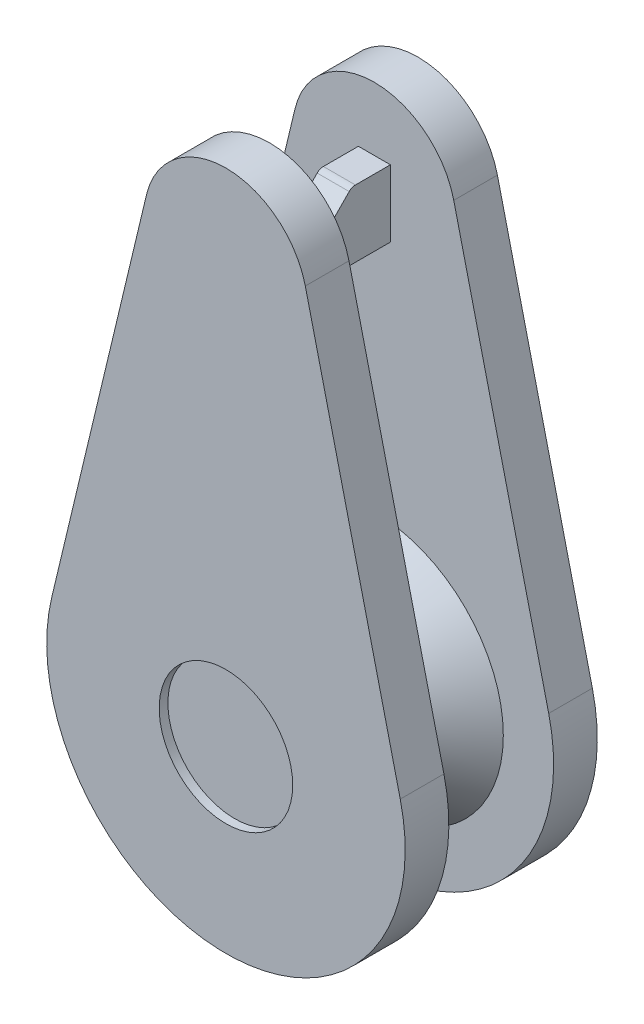
ISO-10303-21;
HEADER;
FILE_DESCRIPTION(('STEP AP214'),'2;1');
FILE_NAME('part.step','',(''),(''),'','','');
FILE_SCHEMA(('AUTOMOTIVE_DESIGN { 1 0 10303 214 1 1 1 1 }'));
ENDSEC;
DATA;
#1=APPLICATION_CONTEXT('core data for automotive mechanical design processes');
#2=APPLICATION_PROTOCOL_DEFINITION('international standard','automotive_design',2000,#1);
#3=PRODUCT_CONTEXT('',#1,'mechanical');
#4=PRODUCT('Part','Part','',(#3));
#5=PRODUCT_RELATED_PRODUCT_CATEGORY('part','',(#4));
#6=PRODUCT_DEFINITION_FORMATION('','',#4);
#7=PRODUCT_DEFINITION_CONTEXT('part definition',#1,'design');
#8=PRODUCT_DEFINITION('design','',#6,#7);
#9=PRODUCT_DEFINITION_SHAPE('','',#8);
#10=(LENGTH_UNIT() NAMED_UNIT(*) SI_UNIT(.MILLI.,.METRE.));
#11=(NAMED_UNIT(*) PLANE_ANGLE_UNIT() SI_UNIT($,.RADIAN.));
#12=(NAMED_UNIT(*) SI_UNIT($,.STERADIAN.) SOLID_ANGLE_UNIT());
#13=UNCERTAINTY_MEASURE_WITH_UNIT(LENGTH_MEASURE(1.E-05),#10,'distance_accuracy_value','');
#14=(GEOMETRIC_REPRESENTATION_CONTEXT(3) GLOBAL_UNCERTAINTY_ASSIGNED_CONTEXT((#13)) GLOBAL_UNIT_ASSIGNED_CONTEXT((#10,
#11,#12)) REPRESENTATION_CONTEXT('',''));
#15=CARTESIAN_POINT('',(0.,0.,0.));
#16=DIRECTION('',(0.,0.,1.));
#17=DIRECTION('',(1.,0.,0.));
#18=AXIS2_PLACEMENT_3D('',#15,#16,#17);
#19=CARTESIAN_POINT('',(24.5,136.000000000001,1.));
#20=DIRECTION('',(0.,0.,1.));
#21=DIRECTION('',(1.,0.,0.));
#22=AXIS2_PLACEMENT_3D('',#19,#20,#21);
#23=PLANE('',#22);
#24=CARTESIAN_POINT('',(24.5,136.000000000001,1.));
#25=DIRECTION('',(0.,0.,1.));
#26=DIRECTION('',(1.,0.,0.));
#27=AXIS2_PLACEMENT_3D('',#24,#25,#26);
#28=CIRCLE('',#27,4.10494291795747);
#29=CARTESIAN_POINT('',(20.5076953119614,136.955018134674,1.));
#30=VERTEX_POINT('',#29);
#31=CARTESIAN_POINT('',(28.4923043974712,136.955019349345,1.));
#32=VERTEX_POINT('',#31);
#33=EDGE_CURVE('E269',#30,#32,#28,.T.);
#34=ORIENTED_EDGE('',*,*,#33,.T.);
#35=DIRECTION('',(-0.232651066879886,0.972560271180995,0.));
#36=VECTOR('',#35,1.);
#37=CARTESIAN_POINT('',(26.3178255819127,146.045077413118,1.));
#38=LINE('',#37,#36);
#39=CARTESIAN_POINT('',(26.3178255819127,146.045077413118,1.));
#40=VERTEX_POINT('',#39);
#41=EDGE_CURVE('E272',#32,#40,#38,.T.);
#42=ORIENTED_EDGE('',*,*,#41,.T.);
#43=CARTESIAN_POINT('',(24.5,145.606873612069,1.));
#44=DIRECTION('',(0.,0.,1.));
#45=DIRECTION('',(-1.,0.,0.));
#46=AXIS2_PLACEMENT_3D('',#43,#44,#45);
#47=CIRCLE('',#46,1.86989636544635);
#48=CARTESIAN_POINT('',(22.681412951381,146.041906443135,1.));
#49=VERTEX_POINT('',#48);
#50=EDGE_CURVE('E275',#40,#49,#47,.T.);
#51=ORIENTED_EDGE('',*,*,#50,.T.);
#52=DIRECTION('',(-0.232650770975412,-0.972560341965755,0.));
#53=VECTOR('',#52,1.);
#54=CARTESIAN_POINT('',(20.5076953119614,136.955018134674,1.));
#55=LINE('',#54,#53);
#56=EDGE_CURVE('E277',#49,#30,#55,.T.);
#57=ORIENTED_EDGE('',*,*,#56,.T.);
#58=EDGE_LOOP('',(#34,#42,#51,#57));
#59=FACE_BOUND('',#58,.T.);
#60=CARTESIAN_POINT('',(24.5,136.000000000001,1.));
#61=DIRECTION('',(0.,0.,1.));
#62=DIRECTION('',(1.,0.,0.));
#63=AXIS2_PLACEMENT_3D('',#60,#61,#62);
#64=CIRCLE('',#63,2.95273846712997);
#65=CARTESIAN_POINT('',(27.45273846713,136.000000000001,1.));
#66=VERTEX_POINT('',#65);
#67=EDGE_CURVE('E265',#66,#66,#64,.T.);
#68=ORIENTED_EDGE('',*,*,#67,.F.);
#69=EDGE_LOOP('',(#68));
#70=FACE_BOUND('',#69,.T.);
#71=DIRECTION('',(-1.,0.,0.));
#72=VECTOR('',#71,1.);
#73=CARTESIAN_POINT('',(24.1333720619488,146.024420810161,1.));
#74=LINE('',#73,#72);
#75=CARTESIAN_POINT('',(24.8666279380512,146.024420810161,1.));
#76=VERTEX_POINT('',#75);
#77=CARTESIAN_POINT('',(24.1333720619488,146.024420810161,1.));
#78=VERTEX_POINT('',#77);
#79=EDGE_CURVE('E248',#76,#78,#74,.T.);
#80=ORIENTED_EDGE('',*,*,#79,.F.);
#81=DIRECTION('',(0.,1.,0.));
#82=VECTOR('',#81,1.);
#83=CARTESIAN_POINT('',(24.8666279380512,146.024420810161,1.));
#84=LINE('',#83,#82);
#85=CARTESIAN_POINT('',(24.8666279380512,144.490732446669,1.));
#86=VERTEX_POINT('',#85);
#87=EDGE_CURVE('E245',#86,#76,#84,.T.);
#88=ORIENTED_EDGE('',*,*,#87,.F.);
#89=DIRECTION('',(1.,0.,0.));
#90=VECTOR('',#89,1.);
#91=CARTESIAN_POINT('',(24.1333720619488,144.490732446669,1.));
#92=LINE('',#91,#90);
#93=CARTESIAN_POINT('',(24.1333720619488,144.490732446669,1.));
#94=VERTEX_POINT('',#93);
#95=EDGE_CURVE('E254',#94,#86,#92,.T.);
#96=ORIENTED_EDGE('',*,*,#95,.F.);
#97=DIRECTION('',(0.,-1.,0.));
#98=VECTOR('',#97,1.);
#99=CARTESIAN_POINT('',(24.1333720619488,146.024420810161,1.));
#100=LINE('',#99,#98);
#101=EDGE_CURVE('E251',#78,#94,#100,.T.);
#102=ORIENTED_EDGE('',*,*,#101,.F.);
#103=EDGE_LOOP('',(#80,#88,#96,#102));
#104=FACE_BOUND('',#103,.T.);
#105=ADVANCED_FACE('F38',(#59,#70,#104),#23,.T.);
#106=CARTESIAN_POINT('',(24.5,136.000000000001,1.));
#107=DIRECTION('',(0.,0.,-1.));
#108=DIRECTION('',(-1.,0.,0.));
#109=AXIS2_PLACEMENT_3D('',#106,#107,#108);
#110=CYLINDRICAL_SURFACE('',#109,4.10494291795747);
#111=CARTESIAN_POINT('',(24.5,136.000000000001,0.));
#112=DIRECTION('',(0.,0.,1.));
#113=DIRECTION('',(1.,0.,0.));
#114=AXIS2_PLACEMENT_3D('',#111,#112,#113);
#115=CIRCLE('',#114,4.10494291795747);
#116=CARTESIAN_POINT('',(20.5076953119614,136.955018134674,0.));
#117=VERTEX_POINT('',#116);
#118=CARTESIAN_POINT('',(28.4923043974712,136.955019349345,0.));
#119=VERTEX_POINT('',#118);
#120=EDGE_CURVE('E268',#117,#119,#115,.T.);
#121=ORIENTED_EDGE('',*,*,#120,.T.);
#122=DIRECTION('',(0.,0.,-1.));
#123=VECTOR('',#122,1.);
#124=CARTESIAN_POINT('',(28.4923043974712,136.955019349345,1.));
#125=LINE('',#124,#123);
#126=EDGE_CURVE('E295',#32,#119,#125,.T.);
#127=ORIENTED_EDGE('',*,*,#126,.F.);
#128=ORIENTED_EDGE('',*,*,#33,.F.);
#129=DIRECTION('',(0.,0.,-1.));
#130=VECTOR('',#129,1.);
#131=CARTESIAN_POINT('',(20.5076953119614,136.955018134674,1.));
#132=LINE('',#131,#130);
#133=EDGE_CURVE('E279',#30,#117,#132,.T.);
#134=ORIENTED_EDGE('',*,*,#133,.T.);
#135=EDGE_LOOP('',(#121,#127,#128,#134));
#136=FACE_BOUND('',#135,.T.);
#137=ADVANCED_FACE('F328',(#136),#110,.T.);
#138=CARTESIAN_POINT('',(26.3178255819127,146.045077413118,1.));
#139=DIRECTION('',(-0.972560271180995,-0.232651066879886,0.));
#140=DIRECTION('',(0.232651066879886,-0.972560271180995,0.));
#141=AXIS2_PLACEMENT_3D('',#138,#139,#140);
#142=PLANE('',#141);
#143=DIRECTION('',(-0.232651066879886,0.972560271180995,0.));
#144=VECTOR('',#143,1.);
#145=CARTESIAN_POINT('',(26.3178255819127,146.045077413118,0.));
#146=LINE('',#145,#144);
#147=CARTESIAN_POINT('',(26.3178255819127,146.045077413118,0.));
#148=VERTEX_POINT('',#147);
#149=EDGE_CURVE('E282',#119,#148,#146,.T.);
#150=ORIENTED_EDGE('',*,*,#149,.T.);
#151=DIRECTION('',(0.,0.,-1.));
#152=VECTOR('',#151,1.);
#153=CARTESIAN_POINT('',(26.3178255819127,146.045077413118,1.));
#154=LINE('',#153,#152);
#155=EDGE_CURVE('E292',#40,#148,#154,.T.);
#156=ORIENTED_EDGE('',*,*,#155,.F.);
#157=ORIENTED_EDGE('',*,*,#41,.F.);
#158=ORIENTED_EDGE('',*,*,#126,.T.);
#159=EDGE_LOOP('',(#150,#156,#157,#158));
#160=FACE_BOUND('',#159,.T.);
#161=ADVANCED_FACE('F334',(#160),#142,.F.);
#162=CARTESIAN_POINT('',(24.5,145.606873612069,1.));
#163=DIRECTION('',(0.,0.,-1.));
#164=DIRECTION('',(-1.,0.,0.));
#165=AXIS2_PLACEMENT_3D('',#162,#163,#164);
#166=CYLINDRICAL_SURFACE('',#165,1.86989636544635);
#167=CARTESIAN_POINT('',(24.5,145.606873612069,0.));
#168=DIRECTION('',(0.,0.,1.));
#169=DIRECTION('',(-1.,0.,0.));
#170=AXIS2_PLACEMENT_3D('',#167,#168,#169);
#171=CIRCLE('',#170,1.86989636544635);
#172=CARTESIAN_POINT('',(22.681412951381,146.041906443135,0.));
#173=VERTEX_POINT('',#172);
#174=EDGE_CURVE('E284',#148,#173,#171,.T.);
#175=ORIENTED_EDGE('',*,*,#174,.T.);
#176=DIRECTION('',(0.,0.,-1.));
#177=VECTOR('',#176,1.);
#178=CARTESIAN_POINT('',(22.681412951381,146.041906443135,1.));
#179=LINE('',#178,#177);
#180=EDGE_CURVE('E289',#49,#173,#179,.T.);
#181=ORIENTED_EDGE('',*,*,#180,.F.);
#182=ORIENTED_EDGE('',*,*,#50,.F.);
#183=ORIENTED_EDGE('',*,*,#155,.T.);
#184=EDGE_LOOP('',(#175,#181,#182,#183));
#185=FACE_BOUND('',#184,.T.);
#186=ADVANCED_FACE('F348',(#185),#166,.T.);
#187=CARTESIAN_POINT('',(20.5076953119614,136.955018134674,1.));
#188=DIRECTION('',(0.972560341965755,-0.232650770975412,0.));
#189=DIRECTION('',(0.232650770975412,0.972560341965755,0.));
#190=AXIS2_PLACEMENT_3D('',#187,#188,#189);
#191=PLANE('',#190);
#192=DIRECTION('',(-0.232650770975412,-0.972560341965755,0.));
#193=VECTOR('',#192,1.);
#194=CARTESIAN_POINT('',(20.5076953119614,136.955018134674,0.));
#195=LINE('',#194,#193);
#196=EDGE_CURVE('E273',#173,#117,#195,.T.);
#197=ORIENTED_EDGE('',*,*,#196,.T.);
#198=ORIENTED_EDGE('',*,*,#133,.F.);
#199=ORIENTED_EDGE('',*,*,#56,.F.);
#200=ORIENTED_EDGE('',*,*,#180,.T.);
#201=EDGE_LOOP('',(#197,#198,#199,#200));
#202=FACE_BOUND('',#201,.T.);
#203=ADVANCED_FACE('F344',(#202),#191,.F.);
#204=CARTESIAN_POINT('',(24.5,136.000000000001,0.));
#205=DIRECTION('',(0.,0.,1.));
#206=DIRECTION('',(1.,0.,0.));
#207=AXIS2_PLACEMENT_3D('',#204,#205,#206);
#208=PLANE('',#207);
#209=ORIENTED_EDGE('',*,*,#120,.F.);
#210=ORIENTED_EDGE('',*,*,#196,.F.);
#211=ORIENTED_EDGE('',*,*,#174,.F.);
#212=ORIENTED_EDGE('',*,*,#149,.F.);
#213=EDGE_LOOP('',(#209,#210,#211,#212));
#214=FACE_BOUND('',#213,.T.);
#215=ADVANCED_FACE('F341',(#214),#208,.F.);
#216=CARTESIAN_POINT('',(24.5,136.000000000001,2.2));
#217=DIRECTION('',(0.,0.,-1.));
#218=DIRECTION('',(-1.,0.,0.));
#219=AXIS2_PLACEMENT_3D('',#216,#217,#218);
#220=CONICAL_SURFACE('',#219,1.73815260557396,0.791438820048917);
#221=CARTESIAN_POINT('',(24.5,136.000000000001,2.05772695129359));
#222=DIRECTION('',(0.,0.,-1.));
#223=DIRECTION('',(-1.,0.,0.));
#224=AXIS2_PLACEMENT_3D('',#221,#222,#223);
#225=CIRCLE('',#224,1.88215496677335);
#226=CARTESIAN_POINT('',(22.6178450332266,136.000000000001,2.05772695129359));
#227=VERTEX_POINT('',#226);
#228=EDGE_CURVE('E46',#227,#227,#225,.T.);
#229=ORIENTED_EDGE('',*,*,#228,.T.);
#230=EDGE_LOOP('',(#229));
#231=FACE_BOUND('',#230,.T.);
#232=ORIENTED_EDGE('',*,*,#67,.T.);
#233=EDGE_LOOP('',(#232));
#234=FACE_BOUND('',#233,.T.);
#235=ADVANCED_FACE('F316',(#231,#234),#220,.T.);
#236=CARTESIAN_POINT('',(24.8666279380512,146.024420810161,3.4));
#237=DIRECTION('',(-1.,0.,0.));
#238=DIRECTION('',(0.,0.,1.));
#239=AXIS2_PLACEMENT_3D('',#236,#237,#238);
#240=PLANE('',#239);
#241=DIRECTION('',(0.,0.,-1.));
#242=VECTOR('',#241,1.);
#243=CARTESIAN_POINT('',(24.8666279380512,146.024420810161,3.4));
#244=LINE('',#243,#242);
#245=CARTESIAN_POINT('',(24.8666279380512,146.024420810161,1.80116368583087));
#246=VERTEX_POINT('',#245);
#247=EDGE_CURVE('E263',#246,#76,#244,.T.);
#248=ORIENTED_EDGE('',*,*,#247,.F.);
#249=CARTESIAN_POINT('',(24.8666279380512,145.824420810161,1.80116368583087));
#250=DIRECTION('',(-1.,0.,0.));
#251=DIRECTION('',(0.,0.,1.));
#252=AXIS2_PLACEMENT_3D('',#249,#250,#251);
#253=CIRCLE('',#252,0.2);
#254=CARTESIAN_POINT('',(24.8666279380512,145.964986025553,1.94343603107641));
#255=VERTEX_POINT('',#254);
#256=EDGE_CURVE('E310',#246,#255,#253,.F.);
#257=ORIENTED_EDGE('',*,*,#256,.T.);
#258=DIRECTION('',(0.,-0.711361726227743,0.702826076962349));
#259=VECTOR('',#258,1.);
#260=CARTESIAN_POINT('',(24.8666279380512,145.266833213032,2.63321168845735));
#261=LINE('',#260,#259);
#262=CARTESIAN_POINT('',(24.8666279380512,144.831297662062,3.0635212361601));
#263=VERTEX_POINT('',#262);
#264=EDGE_CURVE('E243',#255,#263,#261,.T.);
#265=ORIENTED_EDGE('',*,*,#264,.T.);
#266=CARTESIAN_POINT('',(24.8666279380512,144.690732446669,2.92124889091455));
#267=DIRECTION('',(-1.,0.,0.));
#268=DIRECTION('',(0.,0.,1.));
#269=AXIS2_PLACEMENT_3D('',#266,#267,#268);
#270=CIRCLE('',#269,0.2);
#271=CARTESIAN_POINT('',(24.8666279380512,144.490732446669,2.92124889091455));
#272=VERTEX_POINT('',#271);
#273=EDGE_CURVE('E53',#263,#272,#270,.F.);
#274=ORIENTED_EDGE('',*,*,#273,.T.);
#275=DIRECTION('',(0.,0.,-1.));
#276=VECTOR('',#275,1.);
#277=CARTESIAN_POINT('',(24.8666279380512,144.490732446669,3.4));
#278=LINE('',#277,#276);
#279=EDGE_CURVE('E257',#272,#86,#278,.T.);
#280=ORIENTED_EDGE('',*,*,#279,.T.);
#281=ORIENTED_EDGE('',*,*,#87,.T.);
#282=EDGE_LOOP('',(#248,#257,#265,#274,#280,#281));
#283=FACE_BOUND('',#282,.T.);
#284=ADVANCED_FACE('F382',(#283),#240,.F.);
#285=CARTESIAN_POINT('',(24.1333720619488,146.024420810161,3.4));
#286=DIRECTION('',(0.,-1.,0.));
#287=DIRECTION('',(0.,0.,-1.));
#288=AXIS2_PLACEMENT_3D('',#285,#286,#287);
#289=PLANE('',#288);
#290=DIRECTION('',(0.,0.,-1.));
#291=VECTOR('',#290,1.);
#292=CARTESIAN_POINT('',(24.1333720619488,146.024420810161,3.4));
#293=LINE('',#292,#291);
#294=CARTESIAN_POINT('',(24.1333720619488,146.024420810161,1.80116368583087));
#295=VERTEX_POINT('',#294);
#296=EDGE_CURVE('E261',#295,#78,#293,.T.);
#297=ORIENTED_EDGE('',*,*,#296,.F.);
#298=DIRECTION('',(-1.,0.,0.));
#299=VECTOR('',#298,1.);
#300=CARTESIAN_POINT('',(24.1333720619488,146.024420810161,1.80116368583087));
#301=LINE('',#300,#299);
#302=EDGE_CURVE('E61',#295,#246,#301,.F.);
#303=ORIENTED_EDGE('',*,*,#302,.T.);
#304=ORIENTED_EDGE('',*,*,#247,.T.);
#305=ORIENTED_EDGE('',*,*,#79,.T.);
#306=EDGE_LOOP('',(#297,#303,#304,#305));
#307=FACE_BOUND('',#306,.T.);
#308=ADVANCED_FACE('F374',(#307),#289,.F.);
#309=CARTESIAN_POINT('',(24.1333720619488,146.024420810161,3.4));
#310=DIRECTION('',(1.,0.,0.));
#311=DIRECTION('',(0.,0.,-1.));
#312=AXIS2_PLACEMENT_3D('',#309,#310,#311);
#313=PLANE('',#312);
#314=DIRECTION('',(0.,-0.711361726227743,0.702826076962349));
#315=VECTOR('',#314,1.);
#316=CARTESIAN_POINT('',(24.1333720619488,146.024420810161,1.88471440611308));
#317=LINE('',#316,#315);
#318=CARTESIAN_POINT('',(24.1333720619488,145.964986025553,1.94343603107642));
#319=VERTEX_POINT('',#318);
#320=CARTESIAN_POINT('',(24.1333720619488,144.831297662062,3.0635212361601));
#321=VERTEX_POINT('',#320);
#322=EDGE_CURVE('E238',#319,#321,#317,.T.);
#323=ORIENTED_EDGE('',*,*,#322,.F.);
#324=CARTESIAN_POINT('',(24.1333720619488,145.824420810161,1.80116368583087));
#325=DIRECTION('',(1.,0.,0.));
#326=DIRECTION('',(0.,0.,-1.));
#327=AXIS2_PLACEMENT_3D('',#324,#325,#326);
#328=CIRCLE('',#327,0.2);
#329=EDGE_CURVE('E306',#319,#295,#328,.F.);
#330=ORIENTED_EDGE('',*,*,#329,.T.);
#331=ORIENTED_EDGE('',*,*,#296,.T.);
#332=ORIENTED_EDGE('',*,*,#101,.T.);
#333=DIRECTION('',(0.,0.,-1.));
#334=VECTOR('',#333,1.);
#335=CARTESIAN_POINT('',(24.1333720619488,144.490732446669,3.4));
#336=LINE('',#335,#334);
#337=CARTESIAN_POINT('',(24.1333720619488,144.490732446669,2.92124889091455));
#338=VERTEX_POINT('',#337);
#339=EDGE_CURVE('E259',#338,#94,#336,.T.);
#340=ORIENTED_EDGE('',*,*,#339,.F.);
#341=CARTESIAN_POINT('',(24.1333720619488,144.690732446669,2.92124889091455));
#342=DIRECTION('',(1.,0.,0.));
#343=DIRECTION('',(0.,0.,-1.));
#344=AXIS2_PLACEMENT_3D('',#341,#342,#343);
#345=CIRCLE('',#344,0.2);
#346=EDGE_CURVE('E304',#338,#321,#345,.F.);
#347=ORIENTED_EDGE('',*,*,#346,.T.);
#348=EDGE_LOOP('',(#323,#330,#331,#332,#340,#347));
#349=FACE_BOUND('',#348,.T.);
#350=ADVANCED_FACE('F369',(#349),#313,.F.);
#351=CARTESIAN_POINT('',(24.1333720619488,144.490732446669,3.4));
#352=DIRECTION('',(0.,1.,0.));
#353=DIRECTION('',(0.,0.,1.));
#354=AXIS2_PLACEMENT_3D('',#351,#352,#353);
#355=PLANE('',#354);
#356=ORIENTED_EDGE('',*,*,#279,.F.);
#357=DIRECTION('',(1.,0.,0.));
#358=VECTOR('',#357,1.);
#359=CARTESIAN_POINT('',(24.1333720619488,144.490732446669,2.92124889091455));
#360=LINE('',#359,#358);
#361=EDGE_CURVE('E312',#272,#338,#360,.F.);
#362=ORIENTED_EDGE('',*,*,#361,.T.);
#363=ORIENTED_EDGE('',*,*,#339,.T.);
#364=ORIENTED_EDGE('',*,*,#95,.T.);
#365=EDGE_LOOP('',(#356,#362,#363,#364));
#366=FACE_BOUND('',#365,.T.);
#367=ADVANCED_FACE('F381',(#366),#355,.F.);
#368=CARTESIAN_POINT('',(26.5333720619488,146.024420810161,1.88471440611308));
#369=DIRECTION('',(0.,-0.702826076962349,-0.711361726227743));
#370=DIRECTION('',(0.,0.711361726227743,-0.702826076962349));
#371=AXIS2_PLACEMENT_3D('',#368,#369,#370);
#372=PLANE('',#371);
#373=ORIENTED_EDGE('',*,*,#264,.F.);
#374=DIRECTION('',(-1.,0.,0.));
#375=VECTOR('',#374,1.);
#376=CARTESIAN_POINT('',(26.5333720619488,145.964986025553,1.94343603107642));
#377=LINE('',#376,#375);
#378=EDGE_CURVE('E301',#255,#319,#377,.T.);
#379=ORIENTED_EDGE('',*,*,#378,.T.);
#380=ORIENTED_EDGE('',*,*,#322,.T.);
#381=DIRECTION('',(1.,0.,0.));
#382=VECTOR('',#381,1.);
#383=CARTESIAN_POINT('',(26.5333720619488,144.831297662062,3.0635212361601));
#384=LINE('',#383,#382);
#385=EDGE_CURVE('E298',#321,#263,#384,.T.);
#386=ORIENTED_EDGE('',*,*,#385,.T.);
#387=EDGE_LOOP('',(#373,#379,#380,#386));
#388=FACE_BOUND('',#387,.T.);
#389=ADVANCED_FACE('F227',(#388),#372,.F.);
#390=CARTESIAN_POINT('',(26.5333720619488,145.824420810161,1.80116368583087));
#391=DIRECTION('',(-1.,0.,0.));
#392=DIRECTION('',(0.,0.,1.));
#393=AXIS2_PLACEMENT_3D('',#390,#391,#392);
#394=CYLINDRICAL_SURFACE('',#393,0.2);
#395=ORIENTED_EDGE('',*,*,#256,.F.);
#396=ORIENTED_EDGE('',*,*,#302,.F.);
#397=ORIENTED_EDGE('',*,*,#329,.F.);
#398=ORIENTED_EDGE('',*,*,#378,.F.);
#399=EDGE_LOOP('',(#395,#396,#397,#398));
#400=FACE_BOUND('',#399,.T.);
#401=ADVANCED_FACE('F356',(#400),#394,.T.);
#402=CARTESIAN_POINT('',(26.5333720619488,144.690732446669,2.92124889091455));
#403=DIRECTION('',(1.,0.,0.));
#404=DIRECTION('',(0.,0.,-1.));
#405=AXIS2_PLACEMENT_3D('',#402,#403,#404);
#406=CYLINDRICAL_SURFACE('',#405,0.2);
#407=ORIENTED_EDGE('',*,*,#346,.F.);
#408=ORIENTED_EDGE('',*,*,#361,.F.);
#409=ORIENTED_EDGE('',*,*,#273,.F.);
#410=ORIENTED_EDGE('',*,*,#385,.F.);
#411=EDGE_LOOP('',(#407,#408,#409,#410));
#412=FACE_BOUND('',#411,.T.);
#413=ADVANCED_FACE('F225',(#412),#406,.T.);
#414=CARTESIAN_POINT('',(24.5,136.000000000001,2.2));
#415=DIRECTION('',(0.,0.,1.));
#416=DIRECTION('',(-1.,0.,0.));
#417=AXIS2_PLACEMENT_3D('',#414,#415,#416);
#418=CONICAL_SURFACE('',#417,1.73815260557396,0.791438820048917);
#419=CARTESIAN_POINT('',(24.5,136.000000000001,2.34227304870641));
#420=DIRECTION('',(0.,0.,1.));
#421=DIRECTION('',(1.,0.,0.));
#422=AXIS2_PLACEMENT_3D('',#419,#420,#421);
#423=CIRCLE('',#422,1.88215496677335);
#424=CARTESIAN_POINT('',(26.3821549667733,136.000000000001,2.34227304870641));
#425=VERTEX_POINT('',#424);
#426=EDGE_CURVE('E12',#425,#425,#423,.T.);
#427=ORIENTED_EDGE('',*,*,#426,.T.);
#428=EDGE_LOOP('',(#427));
#429=FACE_BOUND('',#428,.T.);
#430=CARTESIAN_POINT('',(24.5,136.000000000001,3.4));
#431=DIRECTION('',(0.,0.,1.));
#432=DIRECTION('',(1.,0.,0.));
#433=AXIS2_PLACEMENT_3D('',#430,#431,#432);
#434=CIRCLE('',#433,2.95273846712997);
#435=CARTESIAN_POINT('',(27.45273846713,136.000000000001,3.4));
#436=VERTEX_POINT('',#435);
#437=EDGE_CURVE('E151',#436,#436,#434,.T.);
#438=ORIENTED_EDGE('',*,*,#437,.F.);
#439=EDGE_LOOP('',(#438));
#440=FACE_BOUND('',#439,.T.);
#441=ADVANCED_FACE('F221',(#429,#440),#418,.T.);
#442=CARTESIAN_POINT('',(24.5,136.000000000001,3.4));
#443=DIRECTION('',(0.,0.,1.));
#444=DIRECTION('',(1.,0.,0.));
#445=AXIS2_PLACEMENT_3D('',#442,#443,#444);
#446=CYLINDRICAL_SURFACE('',#445,4.10494291795747);
#447=CARTESIAN_POINT('',(24.5,136.000000000001,4.4));
#448=DIRECTION('',(0.,0.,1.));
#449=DIRECTION('',(1.,0.,0.));
#450=AXIS2_PLACEMENT_3D('',#447,#448,#449);
#451=CIRCLE('',#450,4.10494291795747);
#452=CARTESIAN_POINT('',(20.5076953119614,136.955018134674,4.4));
#453=VERTEX_POINT('',#452);
#454=CARTESIAN_POINT('',(28.4923043974712,136.955019349345,4.4));
#455=VERTEX_POINT('',#454);
#456=EDGE_CURVE('E146',#453,#455,#451,.T.);
#457=ORIENTED_EDGE('',*,*,#456,.F.);
#458=DIRECTION('',(0.,0.,1.));
#459=VECTOR('',#458,1.);
#460=CARTESIAN_POINT('',(20.5076953119614,136.955018134674,3.4));
#461=LINE('',#460,#459);
#462=CARTESIAN_POINT('',(20.5076953119614,136.955018134674,3.4));
#463=VERTEX_POINT('',#462);
#464=EDGE_CURVE('E140',#463,#453,#461,.T.);
#465=ORIENTED_EDGE('',*,*,#464,.F.);
#466=CARTESIAN_POINT('',(24.5,136.000000000001,3.4));
#467=DIRECTION('',(0.,0.,1.));
#468=DIRECTION('',(1.,0.,0.));
#469=AXIS2_PLACEMENT_3D('',#466,#467,#468);
#470=CIRCLE('',#469,4.10494291795747);
#471=CARTESIAN_POINT('',(28.4923043974712,136.955019349345,3.4));
#472=VERTEX_POINT('',#471);
#473=EDGE_CURVE('E143',#463,#472,#470,.T.);
#474=ORIENTED_EDGE('',*,*,#473,.T.);
#475=DIRECTION('',(0.,0.,1.));
#476=VECTOR('',#475,1.);
#477=CARTESIAN_POINT('',(28.4923043974712,136.955019349345,3.4));
#478=LINE('',#477,#476);
#479=EDGE_CURVE('E171',#472,#455,#478,.T.);
#480=ORIENTED_EDGE('',*,*,#479,.T.);
#481=EDGE_LOOP('',(#457,#465,#474,#480));
#482=FACE_BOUND('',#481,.T.);
#483=ADVANCED_FACE('F142',(#482),#446,.T.);
#484=CARTESIAN_POINT('',(20.5076953119614,136.955018134674,3.4));
#485=DIRECTION('',(-0.972560341965755,0.232650770975412,0.));
#486=DIRECTION('',(-0.232650770975412,-0.972560341965755,0.));
#487=AXIS2_PLACEMENT_3D('',#484,#485,#486);
#488=PLANE('',#487);
#489=DIRECTION('',(-0.232650770975412,-0.972560341965755,0.));
#490=VECTOR('',#489,1.);
#491=CARTESIAN_POINT('',(20.5076953119614,136.955018134674,4.4));
#492=LINE('',#491,#490);
#493=CARTESIAN_POINT('',(22.681412951381,146.041906443135,4.4));
#494=VERTEX_POINT('',#493);
#495=EDGE_CURVE('E173',#494,#453,#492,.T.);
#496=ORIENTED_EDGE('',*,*,#495,.F.);
#497=DIRECTION('',(0.,0.,1.));
#498=VECTOR('',#497,1.);
#499=CARTESIAN_POINT('',(22.681412951381,146.041906443135,3.4));
#500=LINE('',#499,#498);
#501=CARTESIAN_POINT('',(22.681412951381,146.041906443135,3.4));
#502=VERTEX_POINT('',#501);
#503=EDGE_CURVE('E152',#502,#494,#500,.T.);
#504=ORIENTED_EDGE('',*,*,#503,.F.);
#505=DIRECTION('',(-0.232650770975412,-0.972560341965755,0.));
#506=VECTOR('',#505,1.);
#507=CARTESIAN_POINT('',(20.5076953119614,136.955018134674,3.4));
#508=LINE('',#507,#506);
#509=EDGE_CURVE('E158',#502,#463,#508,.T.);
#510=ORIENTED_EDGE('',*,*,#509,.T.);
#511=ORIENTED_EDGE('',*,*,#464,.T.);
#512=EDGE_LOOP('',(#496,#504,#510,#511));
#513=FACE_BOUND('',#512,.T.);
#514=ADVANCED_FACE('F164',(#513),#488,.T.);
#515=CARTESIAN_POINT('',(24.5,145.606873612069,3.4));
#516=DIRECTION('',(0.,0.,1.));
#517=DIRECTION('',(1.,0.,0.));
#518=AXIS2_PLACEMENT_3D('',#515,#516,#517);
#519=CYLINDRICAL_SURFACE('',#518,1.86989636544635);
#520=CARTESIAN_POINT('',(24.5,145.606873612069,4.4));
#521=DIRECTION('',(0.,0.,1.));
#522=DIRECTION('',(-1.,0.,0.));
#523=AXIS2_PLACEMENT_3D('',#520,#521,#522);
#524=CIRCLE('',#523,1.86989636544635);
#525=CARTESIAN_POINT('',(26.3178255819127,146.045077413118,4.4));
#526=VERTEX_POINT('',#525);
#527=EDGE_CURVE('E176',#526,#494,#524,.T.);
#528=ORIENTED_EDGE('',*,*,#527,.F.);
#529=DIRECTION('',(0.,0.,1.));
#530=VECTOR('',#529,1.);
#531=CARTESIAN_POINT('',(26.3178255819127,146.045077413118,3.4));
#532=LINE('',#531,#530);
#533=CARTESIAN_POINT('',(26.3178255819127,146.045077413118,3.4));
#534=VERTEX_POINT('',#533);
#535=EDGE_CURVE('E182',#534,#526,#532,.T.);
#536=ORIENTED_EDGE('',*,*,#535,.F.);
#537=CARTESIAN_POINT('',(24.5,145.606873612069,3.4));
#538=DIRECTION('',(0.,0.,1.));
#539=DIRECTION('',(-1.,0.,0.));
#540=AXIS2_PLACEMENT_3D('',#537,#538,#539);
#541=CIRCLE('',#540,1.86989636544635);
#542=EDGE_CURVE('E165',#534,#502,#541,.T.);
#543=ORIENTED_EDGE('',*,*,#542,.T.);
#544=ORIENTED_EDGE('',*,*,#503,.T.);
#545=EDGE_LOOP('',(#528,#536,#543,#544));
#546=FACE_BOUND('',#545,.T.);
#547=ADVANCED_FACE('F212',(#546),#519,.T.);
#548=CARTESIAN_POINT('',(26.3178255819127,146.045077413118,3.4));
#549=DIRECTION('',(0.972560271180995,0.232651066879886,0.));
#550=DIRECTION('',(-0.232651066879886,0.972560271180995,0.));
#551=AXIS2_PLACEMENT_3D('',#548,#549,#550);
#552=PLANE('',#551);
#553=DIRECTION('',(-0.232651066879886,0.972560271180995,0.));
#554=VECTOR('',#553,1.);
#555=CARTESIAN_POINT('',(26.3178255819127,146.045077413118,4.4));
#556=LINE('',#555,#554);
#557=EDGE_CURVE('E162',#455,#526,#556,.T.);
#558=ORIENTED_EDGE('',*,*,#557,.F.);
#559=ORIENTED_EDGE('',*,*,#479,.F.);
#560=DIRECTION('',(-0.232651066879886,0.972560271180995,0.));
#561=VECTOR('',#560,1.);
#562=CARTESIAN_POINT('',(26.3178255819127,146.045077413118,3.4));
#563=LINE('',#562,#561);
#564=EDGE_CURVE('E161',#472,#534,#563,.T.);
#565=ORIENTED_EDGE('',*,*,#564,.T.);
#566=ORIENTED_EDGE('',*,*,#535,.T.);
#567=EDGE_LOOP('',(#558,#559,#565,#566));
#568=FACE_BOUND('',#567,.T.);
#569=ADVANCED_FACE('F204',(#568),#552,.T.);
#570=CARTESIAN_POINT('',(24.5,136.000000000001,3.4));
#571=DIRECTION('',(0.,0.,-1.));
#572=DIRECTION('',(1.,0.,0.));
#573=AXIS2_PLACEMENT_3D('',#570,#571,#572);
#574=PLANE('',#573);
#575=ORIENTED_EDGE('',*,*,#437,.T.);
#576=EDGE_LOOP('',(#575));
#577=FACE_BOUND('',#576,.T.);
#578=ORIENTED_EDGE('',*,*,#473,.F.);
#579=ORIENTED_EDGE('',*,*,#509,.F.);
#580=ORIENTED_EDGE('',*,*,#542,.F.);
#581=ORIENTED_EDGE('',*,*,#564,.F.);
#582=EDGE_LOOP('',(#578,#579,#580,#581));
#583=FACE_BOUND('',#582,.T.);
#584=ADVANCED_FACE('F156',(#577,#583),#574,.T.);
#585=CARTESIAN_POINT('',(24.5,136.000000000001,4.4));
#586=DIRECTION('',(0.,0.,-1.));
#587=DIRECTION('',(1.,0.,0.));
#588=AXIS2_PLACEMENT_3D('',#585,#586,#587);
#589=PLANE('',#588);
#590=CARTESIAN_POINT('',(24.5,136.000000000001,4.4));
#591=DIRECTION('',(0.,0.,1.));
#592=DIRECTION('',(1.,0.,0.));
#593=AXIS2_PLACEMENT_3D('',#590,#591,#592);
#594=CIRCLE('',#593,1.52935701608279);
#595=CARTESIAN_POINT('',(26.0293570160828,136.000000000001,4.4));
#596=VERTEX_POINT('',#595);
#597=EDGE_CURVE('E479',#596,#596,#594,.T.);
#598=ORIENTED_EDGE('',*,*,#597,.F.);
#599=EDGE_LOOP('',(#598));
#600=FACE_BOUND('',#599,.T.);
#601=ORIENTED_EDGE('',*,*,#456,.T.);
#602=ORIENTED_EDGE('',*,*,#557,.T.);
#603=ORIENTED_EDGE('',*,*,#527,.T.);
#604=ORIENTED_EDGE('',*,*,#495,.T.);
#605=EDGE_LOOP('',(#601,#602,#603,#604));
#606=FACE_BOUND('',#605,.T.);
#607=ADVANCED_FACE('F203',(#600,#606),#589,.F.);
#608=CARTESIAN_POINT('',(24.5,136.000000000001,2.2));
#609=DIRECTION('',(0.,0.,-1.));
#610=DIRECTION('',(-1.,0.,0.));
#611=AXIS2_PLACEMENT_3D('',#608,#609,#610);
#612=TOROIDAL_SURFACE('',#611,2.02271947015804,0.2);
#613=ORIENTED_EDGE('',*,*,#426,.F.);
#614=EDGE_LOOP('',(#613));
#615=FACE_BOUND('',#614,.T.);
#616=ORIENTED_EDGE('',*,*,#228,.F.);
#617=EDGE_LOOP('',(#616));
#618=FACE_BOUND('',#617,.T.);
#619=ADVANCED_FACE('F40',(#615,#618),#612,.F.);
#620=CARTESIAN_POINT('',(24.5,136.000000000001,4.2));
#621=DIRECTION('',(0.,0.,1.));
#622=DIRECTION('',(1.,0.,0.));
#623=AXIS2_PLACEMENT_3D('',#620,#621,#622);
#624=CYLINDRICAL_SURFACE('',#623,1.52935701608279);
#625=CARTESIAN_POINT('',(24.5,136.000000000001,4.2));
#626=DIRECTION('',(0.,0.,1.));
#627=DIRECTION('',(1.,0.,0.));
#628=AXIS2_PLACEMENT_3D('',#625,#626,#627);
#629=CIRCLE('',#628,1.52935701608279);
#630=CARTESIAN_POINT('',(26.0293570160828,136.000000000001,4.2));
#631=VERTEX_POINT('',#630);
#632=EDGE_CURVE('E174',#631,#631,#629,.T.);
#633=ORIENTED_EDGE('',*,*,#632,.F.);
#634=EDGE_LOOP('',(#633));
#635=FACE_BOUND('',#634,.T.);
#636=ORIENTED_EDGE('',*,*,#597,.T.);
#637=EDGE_LOOP('',(#636));
#638=FACE_BOUND('',#637,.T.);
#639=ADVANCED_FACE('F205',(#635,#638),#624,.F.);
#640=CARTESIAN_POINT('',(24.5,136.000000000001,4.2));
#641=DIRECTION('',(0.,0.,1.));
#642=DIRECTION('',(1.,0.,0.));
#643=AXIS2_PLACEMENT_3D('',#640,#641,#642);
#644=PLANE('',#643);
#645=ORIENTED_EDGE('',*,*,#632,.T.);
#646=EDGE_LOOP('',(#645));
#647=FACE_BOUND('',#646,.T.);
#648=ADVANCED_FACE('F324',(#647),#644,.T.);
#649=CLOSED_SHELL('',(#105,#137,#161,#186,#203,#215,#235,#284,#308,#350,#367,#389,#401,#413,
#441,#483,#514,#547,#569,#584,#607,#619,#639,#648));
#650=MANIFOLD_SOLID_BREP('B2',#649);
#651=ADVANCED_BREP_SHAPE_REPRESENTATION('',(#18,#650),#14);
#652=SHAPE_DEFINITION_REPRESENTATION(#9,#651);
ENDSEC;
END-ISO-10303-21;
